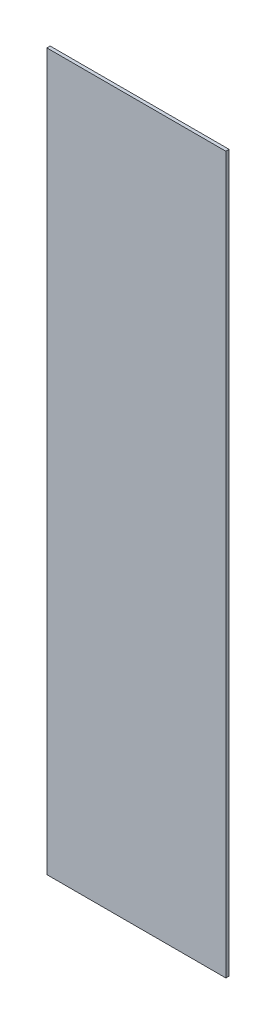
ISO-10303-21;
HEADER;
FILE_DESCRIPTION(('STEP AP214'),'2;1');
FILE_NAME('part.step','',(''),(''),'','','');
FILE_SCHEMA(('AUTOMOTIVE_DESIGN { 1 0 10303 214 1 1 1 1 }'));
ENDSEC;
DATA;
#1=APPLICATION_CONTEXT('core data for automotive mechanical design processes');
#2=APPLICATION_PROTOCOL_DEFINITION('international standard','automotive_design',2000,#1);
#3=PRODUCT_CONTEXT('',#1,'mechanical');
#4=PRODUCT('Part','Part','',(#3));
#5=PRODUCT_RELATED_PRODUCT_CATEGORY('part','',(#4));
#6=PRODUCT_DEFINITION_FORMATION('','',#4);
#7=PRODUCT_DEFINITION_CONTEXT('part definition',#1,'design');
#8=PRODUCT_DEFINITION('design','',#6,#7);
#9=PRODUCT_DEFINITION_SHAPE('','',#8);
#10=(LENGTH_UNIT() NAMED_UNIT(*) SI_UNIT(.MILLI.,.METRE.));
#11=(NAMED_UNIT(*) PLANE_ANGLE_UNIT() SI_UNIT($,.RADIAN.));
#12=(NAMED_UNIT(*) SI_UNIT($,.STERADIAN.) SOLID_ANGLE_UNIT());
#13=UNCERTAINTY_MEASURE_WITH_UNIT(LENGTH_MEASURE(1.E-05),#10,'distance_accuracy_value','');
#14=(GEOMETRIC_REPRESENTATION_CONTEXT(3) GLOBAL_UNCERTAINTY_ASSIGNED_CONTEXT((#13)) GLOBAL_UNIT_ASSIGNED_CONTEXT((#10,
#11,#12)) REPRESENTATION_CONTEXT('',''));
#15=CARTESIAN_POINT('',(0.,0.,0.));
#16=DIRECTION('',(0.,0.,1.));
#17=DIRECTION('',(1.,0.,0.));
#18=AXIS2_PLACEMENT_3D('',#15,#16,#17);
#19=CARTESIAN_POINT('',(0.,0.,11.1125));
#20=DIRECTION('',(1.,0.,0.));
#21=DIRECTION('',(0.,0.,-1.));
#22=AXIS2_PLACEMENT_3D('',#19,#20,#21);
#23=PLANE('',#22);
#24=DIRECTION('',(0.,-1.,0.));
#25=VECTOR('',#24,1.);
#26=CARTESIAN_POINT('',(0.,0.,0.));
#27=LINE('',#26,#25);
#28=CARTESIAN_POINT('',(0.,2438.4,0.));
#29=VERTEX_POINT('',#28);
#30=CARTESIAN_POINT('',(0.,0.,0.));
#31=VERTEX_POINT('',#30);
#32=EDGE_CURVE('E95',#29,#31,#27,.T.);
#33=ORIENTED_EDGE('',*,*,#32,.T.);
#34=DIRECTION('',(0.,0.,-1.));
#35=VECTOR('',#34,1.);
#36=CARTESIAN_POINT('',(0.,0.,11.1125));
#37=LINE('',#36,#35);
#38=CARTESIAN_POINT('',(0.,0.,11.1125));
#39=VERTEX_POINT('',#38);
#40=EDGE_CURVE('E11',#39,#31,#37,.T.);
#41=ORIENTED_EDGE('',*,*,#40,.F.);
#42=DIRECTION('',(0.,-1.,0.));
#43=VECTOR('',#42,1.);
#44=CARTESIAN_POINT('',(0.,0.,11.1125));
#45=LINE('',#44,#43);
#46=CARTESIAN_POINT('',(0.,2438.4,11.1125));
#47=VERTEX_POINT('',#46);
#48=EDGE_CURVE('E83',#47,#39,#45,.T.);
#49=ORIENTED_EDGE('',*,*,#48,.F.);
#50=DIRECTION('',(0.,0.,-1.));
#51=VECTOR('',#50,1.);
#52=CARTESIAN_POINT('',(0.,2438.4,11.1125));
#53=LINE('',#52,#51);
#54=EDGE_CURVE('E91',#47,#29,#53,.T.);
#55=ORIENTED_EDGE('',*,*,#54,.T.);
#56=EDGE_LOOP('',(#33,#41,#49,#55));
#57=FACE_BOUND('',#56,.T.);
#58=ADVANCED_FACE('F32',(#57),#23,.F.);
#59=CARTESIAN_POINT('',(0.,0.,11.1125));
#60=DIRECTION('',(0.,1.,0.));
#61=DIRECTION('',(0.,0.,1.));
#62=AXIS2_PLACEMENT_3D('',#59,#60,#61);
#63=PLANE('',#62);
#64=DIRECTION('',(1.,0.,0.));
#65=VECTOR('',#64,1.);
#66=CARTESIAN_POINT('',(0.,0.,0.));
#67=LINE('',#66,#65);
#68=CARTESIAN_POINT('',(609.6,0.,0.));
#69=VERTEX_POINT('',#68);
#70=EDGE_CURVE('E87',#31,#69,#67,.T.);
#71=ORIENTED_EDGE('',*,*,#70,.T.);
#72=DIRECTION('',(0.,0.,-1.));
#73=VECTOR('',#72,1.);
#74=CARTESIAN_POINT('',(609.6,0.,11.1125));
#75=LINE('',#74,#73);
#76=CARTESIAN_POINT('',(609.6,0.,11.1125));
#77=VERTEX_POINT('',#76);
#78=EDGE_CURVE('E40',#77,#69,#75,.T.);
#79=ORIENTED_EDGE('',*,*,#78,.F.);
#80=DIRECTION('',(1.,0.,0.));
#81=VECTOR('',#80,1.);
#82=CARTESIAN_POINT('',(0.,0.,11.1125));
#83=LINE('',#82,#81);
#84=EDGE_CURVE('E78',#39,#77,#83,.T.);
#85=ORIENTED_EDGE('',*,*,#84,.F.);
#86=ORIENTED_EDGE('',*,*,#40,.T.);
#87=EDGE_LOOP('',(#71,#79,#85,#86));
#88=FACE_BOUND('',#87,.T.);
#89=ADVANCED_FACE('F86',(#88),#63,.F.);
#90=CARTESIAN_POINT('',(609.6,0.,11.1125));
#91=DIRECTION('',(-1.,0.,0.));
#92=DIRECTION('',(0.,0.,1.));
#93=AXIS2_PLACEMENT_3D('',#90,#91,#92);
#94=PLANE('',#93);
#95=DIRECTION('',(0.,1.,0.));
#96=VECTOR('',#95,1.);
#97=CARTESIAN_POINT('',(609.6,0.,0.));
#98=LINE('',#97,#96);
#99=CARTESIAN_POINT('',(609.6,2438.4,0.));
#100=VERTEX_POINT('',#99);
#101=EDGE_CURVE('E65',#69,#100,#98,.T.);
#102=ORIENTED_EDGE('',*,*,#101,.T.);
#103=DIRECTION('',(0.,0.,-1.));
#104=VECTOR('',#103,1.);
#105=CARTESIAN_POINT('',(609.6,2438.4,11.1125));
#106=LINE('',#105,#104);
#107=CARTESIAN_POINT('',(609.6,2438.4,11.1125));
#108=VERTEX_POINT('',#107);
#109=EDGE_CURVE('E88',#108,#100,#106,.T.);
#110=ORIENTED_EDGE('',*,*,#109,.F.);
#111=DIRECTION('',(0.,1.,0.));
#112=VECTOR('',#111,1.);
#113=CARTESIAN_POINT('',(609.6,0.,11.1125));
#114=LINE('',#113,#112);
#115=EDGE_CURVE('E81',#77,#108,#114,.T.);
#116=ORIENTED_EDGE('',*,*,#115,.F.);
#117=ORIENTED_EDGE('',*,*,#78,.T.);
#118=EDGE_LOOP('',(#102,#110,#116,#117));
#119=FACE_BOUND('',#118,.T.);
#120=ADVANCED_FACE('F89',(#119),#94,.F.);
#121=CARTESIAN_POINT('',(0.,2438.4,11.1125));
#122=DIRECTION('',(0.,-1.,0.));
#123=DIRECTION('',(0.,0.,-1.));
#124=AXIS2_PLACEMENT_3D('',#121,#122,#123);
#125=PLANE('',#124);
#126=DIRECTION('',(-1.,0.,0.));
#127=VECTOR('',#126,1.);
#128=CARTESIAN_POINT('',(0.,2438.4,0.));
#129=LINE('',#128,#127);
#130=EDGE_CURVE('E71',#100,#29,#129,.T.);
#131=ORIENTED_EDGE('',*,*,#130,.T.);
#132=ORIENTED_EDGE('',*,*,#54,.F.);
#133=DIRECTION('',(-1.,0.,0.));
#134=VECTOR('',#133,1.);
#135=CARTESIAN_POINT('',(0.,2438.4,11.1125));
#136=LINE('',#135,#134);
#137=EDGE_CURVE('E48',#108,#47,#136,.T.);
#138=ORIENTED_EDGE('',*,*,#137,.F.);
#139=ORIENTED_EDGE('',*,*,#109,.T.);
#140=EDGE_LOOP('',(#131,#132,#138,#139));
#141=FACE_BOUND('',#140,.T.);
#142=ADVANCED_FACE('F102',(#141),#125,.F.);
#143=CARTESIAN_POINT('',(0.,0.,11.1125));
#144=DIRECTION('',(0.,0.,-1.));
#145=DIRECTION('',(-1.,0.,0.));
#146=AXIS2_PLACEMENT_3D('',#143,#144,#145);
#147=PLANE('',#146);
#148=ORIENTED_EDGE('',*,*,#48,.T.);
#149=ORIENTED_EDGE('',*,*,#84,.T.);
#150=ORIENTED_EDGE('',*,*,#115,.T.);
#151=ORIENTED_EDGE('',*,*,#137,.T.);
#152=EDGE_LOOP('',(#148,#149,#150,#151));
#153=FACE_BOUND('',#152,.T.);
#154=ADVANCED_FACE('F79',(#153),#147,.F.);
#155=CARTESIAN_POINT('',(0.,0.,0.));
#156=DIRECTION('',(0.,0.,-1.));
#157=DIRECTION('',(-1.,0.,0.));
#158=AXIS2_PLACEMENT_3D('',#155,#156,#157);
#159=PLANE('',#158);
#160=ORIENTED_EDGE('',*,*,#32,.F.);
#161=ORIENTED_EDGE('',*,*,#130,.F.);
#162=ORIENTED_EDGE('',*,*,#101,.F.);
#163=ORIENTED_EDGE('',*,*,#70,.F.);
#164=EDGE_LOOP('',(#160,#161,#162,#163));
#165=FACE_BOUND('',#164,.T.);
#166=ADVANCED_FACE('F105',(#165),#159,.T.);
#167=CLOSED_SHELL('',(#58,#89,#120,#142,#154,#166));
#168=MANIFOLD_SOLID_BREP('B2',#167);
#169=ADVANCED_BREP_SHAPE_REPRESENTATION('',(#18,#168),#14);
#170=SHAPE_DEFINITION_REPRESENTATION(#9,#169);
ENDSEC;
END-ISO-10303-21;
